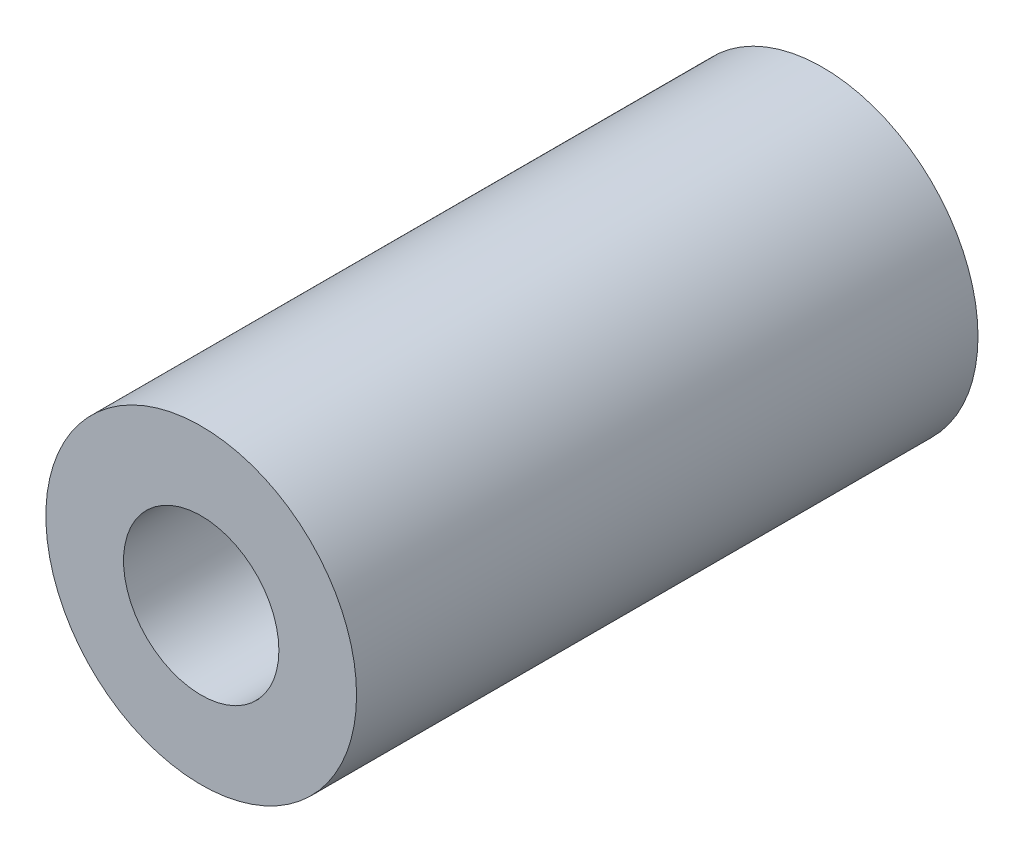
ISO-10303-21;
HEADER;
FILE_DESCRIPTION(('STEP AP214'),'2;1');
FILE_NAME('part.step','',(''),(''),'','','');
FILE_SCHEMA(('AUTOMOTIVE_DESIGN { 1 0 10303 214 1 1 1 1 }'));
ENDSEC;
DATA;
#1=APPLICATION_CONTEXT('core data for automotive mechanical design processes');
#2=APPLICATION_PROTOCOL_DEFINITION('international standard','automotive_design',2000,#1);
#3=PRODUCT_CONTEXT('',#1,'mechanical');
#4=PRODUCT('Part','Part','',(#3));
#5=PRODUCT_RELATED_PRODUCT_CATEGORY('part','',(#4));
#6=PRODUCT_DEFINITION_FORMATION('','',#4);
#7=PRODUCT_DEFINITION_CONTEXT('part definition',#1,'design');
#8=PRODUCT_DEFINITION('design','',#6,#7);
#9=PRODUCT_DEFINITION_SHAPE('','',#8);
#10=(LENGTH_UNIT() NAMED_UNIT(*) SI_UNIT(.MILLI.,.METRE.));
#11=(NAMED_UNIT(*) PLANE_ANGLE_UNIT() SI_UNIT($,.RADIAN.));
#12=(NAMED_UNIT(*) SI_UNIT($,.STERADIAN.) SOLID_ANGLE_UNIT());
#13=UNCERTAINTY_MEASURE_WITH_UNIT(LENGTH_MEASURE(1.E-05),#10,'distance_accuracy_value','');
#14=(GEOMETRIC_REPRESENTATION_CONTEXT(3) GLOBAL_UNCERTAINTY_ASSIGNED_CONTEXT((#13)) GLOBAL_UNIT_ASSIGNED_CONTEXT((#10,
#11,#12)) REPRESENTATION_CONTEXT('',''));
#15=CARTESIAN_POINT('',(0.,0.,0.));
#16=DIRECTION('',(0.,0.,1.));
#17=DIRECTION('',(1.,0.,0.));
#18=AXIS2_PLACEMENT_3D('',#15,#16,#17);
#19=CARTESIAN_POINT('',(0.,0.,50.8));
#20=DIRECTION('',(0.,0.,1.));
#21=DIRECTION('',(1.,0.,0.));
#22=AXIS2_PLACEMENT_3D('',#19,#20,#21);
#23=PLANE('',#22);
#24=CARTESIAN_POINT('',(0.,0.,50.8));
#25=DIRECTION('',(0.,0.,1.));
#26=DIRECTION('',(1.,0.,0.));
#27=AXIS2_PLACEMENT_3D('',#24,#25,#26);
#28=CIRCLE('',#27,12.7);
#29=CARTESIAN_POINT('',(12.7,0.,50.8));
#30=VERTEX_POINT('',#29);
#31=EDGE_CURVE('E10',#30,#30,#28,.T.);
#32=ORIENTED_EDGE('',*,*,#31,.T.);
#33=EDGE_LOOP('',(#32));
#34=FACE_BOUND('',#33,.T.);
#35=CARTESIAN_POINT('',(0.,0.,50.8));
#36=DIRECTION('',(0.,0.,1.));
#37=DIRECTION('',(1.,0.,0.));
#38=AXIS2_PLACEMENT_3D('',#35,#36,#37);
#39=CIRCLE('',#38,6.35);
#40=CARTESIAN_POINT('',(6.35,0.,50.8));
#41=VERTEX_POINT('',#40);
#42=EDGE_CURVE('E50',#41,#41,#39,.T.);
#43=ORIENTED_EDGE('',*,*,#42,.F.);
#44=EDGE_LOOP('',(#43));
#45=FACE_BOUND('',#44,.T.);
#46=ADVANCED_FACE('F39',(#34,#45),#23,.T.);
#47=CARTESIAN_POINT('',(0.,0.,0.));
#48=DIRECTION('',(0.,0.,1.));
#49=DIRECTION('',(1.,0.,0.));
#50=AXIS2_PLACEMENT_3D('',#47,#48,#49);
#51=PLANE('',#50);
#52=CARTESIAN_POINT('',(0.,0.,0.));
#53=DIRECTION('',(0.,0.,1.));
#54=DIRECTION('',(1.,0.,0.));
#55=AXIS2_PLACEMENT_3D('',#52,#53,#54);
#56=CIRCLE('',#55,12.7);
#57=CARTESIAN_POINT('',(12.7,0.,0.));
#58=VERTEX_POINT('',#57);
#59=EDGE_CURVE('E43',#58,#58,#56,.T.);
#60=ORIENTED_EDGE('',*,*,#59,.F.);
#61=EDGE_LOOP('',(#60));
#62=FACE_BOUND('',#61,.T.);
#63=CARTESIAN_POINT('',(0.,0.,0.));
#64=DIRECTION('',(0.,0.,1.));
#65=DIRECTION('',(1.,0.,0.));
#66=AXIS2_PLACEMENT_3D('',#63,#64,#65);
#67=CIRCLE('',#66,6.35);
#68=CARTESIAN_POINT('',(6.35,0.,0.));
#69=VERTEX_POINT('',#68);
#70=EDGE_CURVE('E52',#69,#69,#67,.T.);
#71=ORIENTED_EDGE('',*,*,#70,.T.);
#72=EDGE_LOOP('',(#71));
#73=FACE_BOUND('',#72,.T.);
#74=ADVANCED_FACE('F62',(#62,#73),#51,.F.);
#75=CARTESIAN_POINT('',(0.,0.,50.8));
#76=DIRECTION('',(0.,0.,-1.));
#77=DIRECTION('',(-1.,0.,0.));
#78=AXIS2_PLACEMENT_3D('',#75,#76,#77);
#79=CYLINDRICAL_SURFACE('',#78,12.7);
#80=ORIENTED_EDGE('',*,*,#31,.F.);
#81=EDGE_LOOP('',(#80));
#82=FACE_BOUND('',#81,.T.);
#83=ORIENTED_EDGE('',*,*,#59,.T.);
#84=EDGE_LOOP('',(#83));
#85=FACE_BOUND('',#84,.T.);
#86=ADVANCED_FACE('F41',(#82,#85),#79,.T.);
#87=CARTESIAN_POINT('',(0.,0.,50.8));
#88=DIRECTION('',(0.,0.,-1.));
#89=DIRECTION('',(-1.,0.,0.));
#90=AXIS2_PLACEMENT_3D('',#87,#88,#89);
#91=CYLINDRICAL_SURFACE('',#90,6.35);
#92=ORIENTED_EDGE('',*,*,#42,.T.);
#93=EDGE_LOOP('',(#92));
#94=FACE_BOUND('',#93,.T.);
#95=ORIENTED_EDGE('',*,*,#70,.F.);
#96=EDGE_LOOP('',(#95));
#97=FACE_BOUND('',#96,.T.);
#98=ADVANCED_FACE('F58',(#94,#97),#91,.F.);
#99=CLOSED_SHELL('',(#46,#74,#86,#98));
#100=MANIFOLD_SOLID_BREP('B2',#99);
#101=ADVANCED_BREP_SHAPE_REPRESENTATION('',(#18,#100),#14);
#102=SHAPE_DEFINITION_REPRESENTATION(#9,#101);
ENDSEC;
END-ISO-10303-21;
